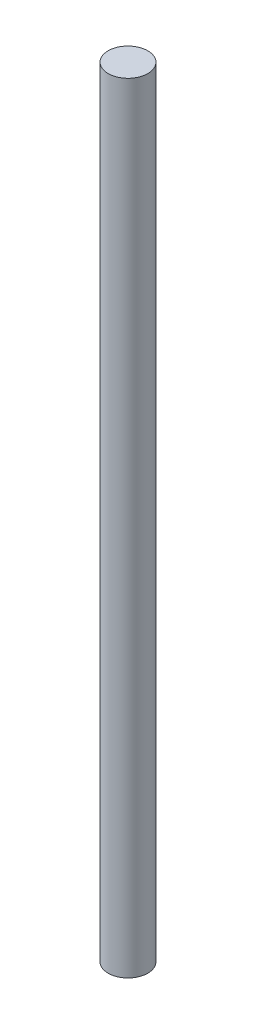
ISO-10303-21;
HEADER;
FILE_DESCRIPTION(('STEP AP214'),'2;1');
FILE_NAME('part.step','',(''),(''),'','','');
FILE_SCHEMA(('AUTOMOTIVE_DESIGN { 1 0 10303 214 1 1 1 1 }'));
ENDSEC;
DATA;
#1=APPLICATION_CONTEXT('core data for automotive mechanical design processes');
#2=APPLICATION_PROTOCOL_DEFINITION('international standard','automotive_design',2000,#1);
#3=PRODUCT_CONTEXT('',#1,'mechanical');
#4=PRODUCT('Part','Part','',(#3));
#5=PRODUCT_RELATED_PRODUCT_CATEGORY('part','',(#4));
#6=PRODUCT_DEFINITION_FORMATION('','',#4);
#7=PRODUCT_DEFINITION_CONTEXT('part definition',#1,'design');
#8=PRODUCT_DEFINITION('design','',#6,#7);
#9=PRODUCT_DEFINITION_SHAPE('','',#8);
#10=(LENGTH_UNIT() NAMED_UNIT(*) SI_UNIT(.MILLI.,.METRE.));
#11=(NAMED_UNIT(*) PLANE_ANGLE_UNIT() SI_UNIT($,.RADIAN.));
#12=(NAMED_UNIT(*) SI_UNIT($,.STERADIAN.) SOLID_ANGLE_UNIT());
#13=UNCERTAINTY_MEASURE_WITH_UNIT(LENGTH_MEASURE(1.E-05),#10,'distance_accuracy_value','');
#14=(GEOMETRIC_REPRESENTATION_CONTEXT(3) GLOBAL_UNCERTAINTY_ASSIGNED_CONTEXT((#13)) GLOBAL_UNIT_ASSIGNED_CONTEXT((#10,
#11,#12)) REPRESENTATION_CONTEXT('',''));
#15=CARTESIAN_POINT('',(0.,0.,0.));
#16=DIRECTION('',(0.,0.,1.));
#17=DIRECTION('',(1.,0.,0.));
#18=AXIS2_PLACEMENT_3D('',#15,#16,#17);
#19=CARTESIAN_POINT('',(0.,76.2,0.));
#20=DIRECTION('',(0.,-1.,0.));
#21=DIRECTION('',(0.,0.,-1.));
#22=AXIS2_PLACEMENT_3D('',#19,#20,#21);
#23=CYLINDRICAL_SURFACE('',#22,1.93499994);
#24=CARTESIAN_POINT('',(0.,76.2,0.));
#25=DIRECTION('',(0.,1.,0.));
#26=DIRECTION('',(0.,0.,1.));
#27=AXIS2_PLACEMENT_3D('',#24,#25,#26);
#28=CIRCLE('',#27,1.93499994);
#29=CARTESIAN_POINT('',(0.,76.2,1.93499994));
#30=VERTEX_POINT('',#29);
#31=EDGE_CURVE('E10',#30,#30,#28,.T.);
#32=ORIENTED_EDGE('',*,*,#31,.F.);
#33=EDGE_LOOP('',(#32));
#34=FACE_BOUND('',#33,.T.);
#35=CARTESIAN_POINT('',(0.,0.,0.));
#36=DIRECTION('',(0.,1.,0.));
#37=DIRECTION('',(0.,0.,1.));
#38=AXIS2_PLACEMENT_3D('',#35,#36,#37);
#39=CIRCLE('',#38,1.93499994);
#40=CARTESIAN_POINT('',(0.,0.,1.93499994));
#41=VERTEX_POINT('',#40);
#42=EDGE_CURVE('E33',#41,#41,#39,.T.);
#43=ORIENTED_EDGE('',*,*,#42,.T.);
#44=EDGE_LOOP('',(#43));
#45=FACE_BOUND('',#44,.T.);
#46=ADVANCED_FACE('F30',(#34,#45),#23,.T.);
#47=CARTESIAN_POINT('',(0.,76.2,0.));
#48=DIRECTION('',(0.,1.,0.));
#49=DIRECTION('',(0.,0.,1.));
#50=AXIS2_PLACEMENT_3D('',#47,#48,#49);
#51=PLANE('',#50);
#52=ORIENTED_EDGE('',*,*,#31,.T.);
#53=EDGE_LOOP('',(#52));
#54=FACE_BOUND('',#53,.T.);
#55=ADVANCED_FACE('F45',(#54),#51,.T.);
#56=CARTESIAN_POINT('',(0.,0.,0.));
#57=DIRECTION('',(0.,1.,0.));
#58=DIRECTION('',(0.,0.,1.));
#59=AXIS2_PLACEMENT_3D('',#56,#57,#58);
#60=PLANE('',#59);
#61=ORIENTED_EDGE('',*,*,#42,.F.);
#62=EDGE_LOOP('',(#61));
#63=FACE_BOUND('',#62,.T.);
#64=ADVANCED_FACE('F43',(#63),#60,.F.);
#65=CLOSED_SHELL('',(#46,#55,#64));
#66=MANIFOLD_SOLID_BREP('B2',#65);
#67=ADVANCED_BREP_SHAPE_REPRESENTATION('',(#18,#66),#14);
#68=SHAPE_DEFINITION_REPRESENTATION(#9,#67);
ENDSEC;
END-ISO-10303-21;
